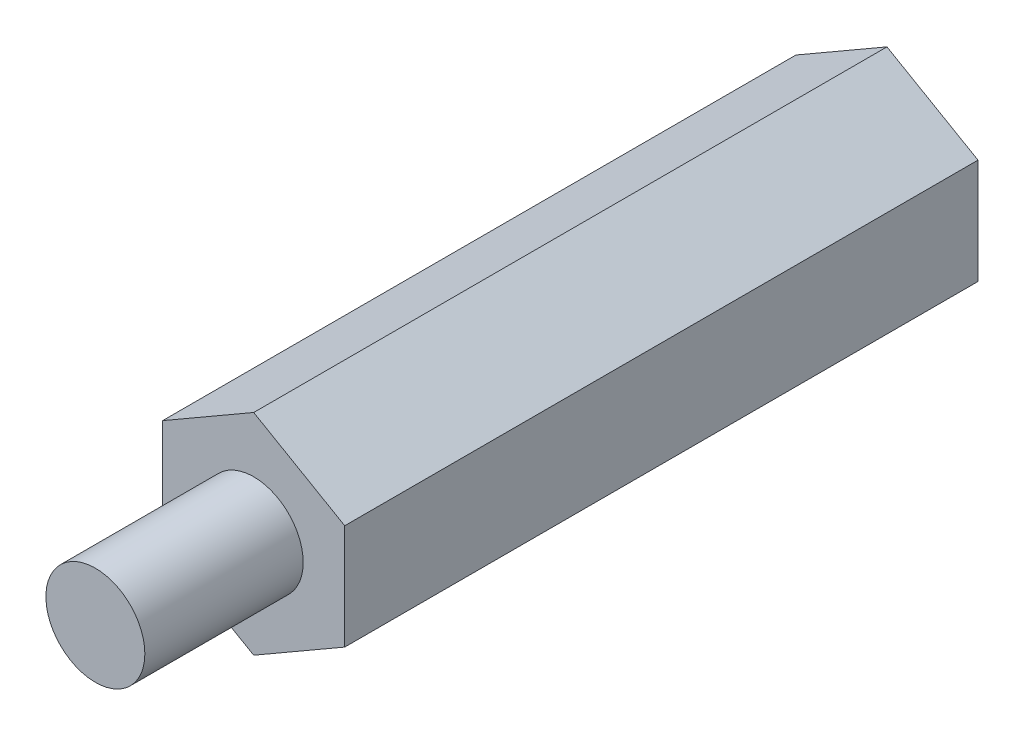
ISO-10303-21;
HEADER;
FILE_DESCRIPTION(('STEP AP214'),'2;1');
FILE_NAME('part.step','',(''),(''),'','','');
FILE_SCHEMA(('AUTOMOTIVE_DESIGN { 1 0 10303 214 1 1 1 1 }'));
ENDSEC;
DATA;
#1=APPLICATION_CONTEXT('core data for automotive mechanical design processes');
#2=APPLICATION_PROTOCOL_DEFINITION('international standard','automotive_design',2000,#1);
#3=PRODUCT_CONTEXT('',#1,'mechanical');
#4=PRODUCT('Part','Part','',(#3));
#5=PRODUCT_RELATED_PRODUCT_CATEGORY('part','',(#4));
#6=PRODUCT_DEFINITION_FORMATION('','',#4);
#7=PRODUCT_DEFINITION_CONTEXT('part definition',#1,'design');
#8=PRODUCT_DEFINITION('design','',#6,#7);
#9=PRODUCT_DEFINITION_SHAPE('','',#8);
#10=(LENGTH_UNIT() NAMED_UNIT(*) SI_UNIT(.MILLI.,.METRE.));
#11=(NAMED_UNIT(*) PLANE_ANGLE_UNIT() SI_UNIT($,.RADIAN.));
#12=(NAMED_UNIT(*) SI_UNIT($,.STERADIAN.) SOLID_ANGLE_UNIT());
#13=UNCERTAINTY_MEASURE_WITH_UNIT(LENGTH_MEASURE(1.E-05),#10,'distance_accuracy_value','');
#14=(GEOMETRIC_REPRESENTATION_CONTEXT(3) GLOBAL_UNCERTAINTY_ASSIGNED_CONTEXT((#13)) GLOBAL_UNIT_ASSIGNED_CONTEXT((#10,
#11,#12)) REPRESENTATION_CONTEXT('',''));
#15=CARTESIAN_POINT('',(0.,0.,0.));
#16=DIRECTION('',(0.,0.,1.));
#17=DIRECTION('',(1.,0.,0.));
#18=AXIS2_PLACEMENT_3D('',#15,#16,#17);
#19=CARTESIAN_POINT('',(2.3,1.32790561913614,0.));
#20=DIRECTION('',(0.5,0.866025403784439,0.));
#21=DIRECTION('',(0.,0.,-1.));
#22=AXIS2_PLACEMENT_3D('',#19,#20,#21);
#23=PLANE('',#22);
#24=DIRECTION('',(0.,0.,1.));
#25=VECTOR('',#24,1.);
#26=CARTESIAN_POINT('',(2.3,1.32790561913614,0.));
#27=LINE('',#26,#25);
#28=CARTESIAN_POINT('',(2.3,1.32790561913614,6.));
#29=VERTEX_POINT('',#28);
#30=CARTESIAN_POINT('',(2.3,1.32790561913614,22.));
#31=VERTEX_POINT('',#30);
#32=EDGE_CURVE('E28',#29,#31,#27,.T.);
#33=ORIENTED_EDGE('',*,*,#32,.F.);
#34=DIRECTION('',(0.866025403784439,-0.5,0.));
#35=VECTOR('',#34,1.);
#36=CARTESIAN_POINT('',(1.725,1.65988202392017,6.));
#37=LINE('',#36,#35);
#38=CARTESIAN_POINT('',(0.,2.65581123827228,6.));
#39=VERTEX_POINT('',#38);
#40=EDGE_CURVE('E194',#39,#29,#37,.T.);
#41=ORIENTED_EDGE('',*,*,#40,.F.);
#42=DIRECTION('',(0.,0.,1.));
#43=VECTOR('',#42,1.);
#44=CARTESIAN_POINT('',(0.,2.65581123827228,0.));
#45=LINE('',#44,#43);
#46=CARTESIAN_POINT('',(0.,2.65581123827228,22.));
#47=VERTEX_POINT('',#46);
#48=EDGE_CURVE('E108',#39,#47,#45,.T.);
#49=ORIENTED_EDGE('',*,*,#48,.T.);
#50=DIRECTION('',(-0.866025403784439,0.5,0.));
#51=VECTOR('',#50,1.);
#52=CARTESIAN_POINT('',(1.725,1.65988202392017,22.));
#53=LINE('',#52,#51);
#54=EDGE_CURVE('E124',#31,#47,#53,.T.);
#55=ORIENTED_EDGE('',*,*,#54,.F.);
#56=EDGE_LOOP('',(#33,#41,#49,#55));
#57=FACE_BOUND('',#56,.T.);
#58=ADVANCED_FACE('F17',(#57),#23,.T.);
#59=CARTESIAN_POINT('',(0.,0.,0.));
#60=DIRECTION('',(0.,0.,1.));
#61=DIRECTION('',(1.,0.,0.));
#62=AXIS2_PLACEMENT_3D('',#59,#60,#61);
#63=CYLINDRICAL_SURFACE('',#62,1.25);
#64=CARTESIAN_POINT('',(0.,0.,20.));
#65=DIRECTION('',(0.,0.,1.));
#66=DIRECTION('',(1.,0.,0.));
#67=AXIS2_PLACEMENT_3D('',#64,#65,#66);
#68=CIRCLE('',#67,1.25);
#69=CARTESIAN_POINT('',(-1.25,0.,20.));
#70=VERTEX_POINT('',#69);
#71=EDGE_CURVE('E125',#70,#70,#68,.T.);
#72=ORIENTED_EDGE('',*,*,#71,.T.);
#73=DIRECTION('',(0.,0.,-1.));
#74=VECTOR('',#73,1.);
#75=CARTESIAN_POINT('',(-1.25,0.,0.));
#76=LINE('',#75,#74);
#77=CARTESIAN_POINT('',(-1.25,0.,6.));
#78=VERTEX_POINT('',#77);
#79=EDGE_CURVE('E11',#70,#78,#76,.T.);
#80=ORIENTED_EDGE('',*,*,#79,.T.);
#81=CARTESIAN_POINT('',(0.,0.,6.));
#82=DIRECTION('',(0.,0.,1.));
#83=DIRECTION('',(1.,0.,0.));
#84=AXIS2_PLACEMENT_3D('',#81,#82,#83);
#85=CIRCLE('',#84,1.25);
#86=EDGE_CURVE('E21',#78,#78,#85,.T.);
#87=ORIENTED_EDGE('',*,*,#86,.F.);
#88=ORIENTED_EDGE('',*,*,#79,.F.);
#89=EDGE_LOOP('',(#72,#80,#87,#88));
#90=FACE_BOUND('',#89,.T.);
#91=ADVANCED_FACE('F210',(#90),#63,.F.);
#92=CARTESIAN_POINT('',(2.3,-1.32790561913614,0.));
#93=DIRECTION('',(1.,0.,0.));
#94=DIRECTION('',(0.,-1.,0.));
#95=AXIS2_PLACEMENT_3D('',#92,#93,#94);
#96=PLANE('',#95);
#97=DIRECTION('',(0.,0.,1.));
#98=VECTOR('',#97,1.);
#99=CARTESIAN_POINT('',(2.3,-1.32790561913614,0.));
#100=LINE('',#99,#98);
#101=CARTESIAN_POINT('',(2.3,-1.32790561913614,6.));
#102=VERTEX_POINT('',#101);
#103=CARTESIAN_POINT('',(2.3,-1.32790561913614,22.));
#104=VERTEX_POINT('',#103);
#105=EDGE_CURVE('E96',#102,#104,#100,.T.);
#106=ORIENTED_EDGE('',*,*,#105,.F.);
#107=DIRECTION('',(0.,-1.,0.));
#108=VECTOR('',#107,1.);
#109=CARTESIAN_POINT('',(2.3,-0.663952809568071,6.));
#110=LINE('',#109,#108);
#111=EDGE_CURVE('E143',#29,#102,#110,.T.);
#112=ORIENTED_EDGE('',*,*,#111,.F.);
#113=ORIENTED_EDGE('',*,*,#32,.T.);
#114=DIRECTION('',(0.,1.,0.));
#115=VECTOR('',#114,1.);
#116=CARTESIAN_POINT('',(2.3,-0.663952809568071,22.));
#117=LINE('',#116,#115);
#118=EDGE_CURVE('E114',#104,#31,#117,.T.);
#119=ORIENTED_EDGE('',*,*,#118,.F.);
#120=EDGE_LOOP('',(#106,#112,#113,#119));
#121=FACE_BOUND('',#120,.T.);
#122=ADVANCED_FACE('F120',(#121),#96,.T.);
#123=CARTESIAN_POINT('',(0.,-2.65581123827228,0.));
#124=DIRECTION('',(0.5,-0.866025403784439,0.));
#125=DIRECTION('',(0.,0.,-1.));
#126=AXIS2_PLACEMENT_3D('',#123,#124,#125);
#127=PLANE('',#126);
#128=DIRECTION('',(0.,0.,1.));
#129=VECTOR('',#128,1.);
#130=CARTESIAN_POINT('',(0.,-2.65581123827228,0.));
#131=LINE('',#130,#129);
#132=CARTESIAN_POINT('',(0.,-2.65581123827228,6.));
#133=VERTEX_POINT('',#132);
#134=CARTESIAN_POINT('',(0.,-2.65581123827228,22.));
#135=VERTEX_POINT('',#134);
#136=EDGE_CURVE('E42',#133,#135,#131,.T.);
#137=ORIENTED_EDGE('',*,*,#136,.F.);
#138=DIRECTION('',(-0.866025403784439,-0.5,0.));
#139=VECTOR('',#138,1.);
#140=CARTESIAN_POINT('',(0.575,-2.32383483348824,6.));
#141=LINE('',#140,#139);
#142=EDGE_CURVE('E102',#102,#133,#141,.T.);
#143=ORIENTED_EDGE('',*,*,#142,.F.);
#144=ORIENTED_EDGE('',*,*,#105,.T.);
#145=DIRECTION('',(0.866025403784439,0.5,0.));
#146=VECTOR('',#145,1.);
#147=CARTESIAN_POINT('',(0.575,-2.32383483348824,22.));
#148=LINE('',#147,#146);
#149=EDGE_CURVE('E99',#135,#104,#148,.T.);
#150=ORIENTED_EDGE('',*,*,#149,.F.);
#151=EDGE_LOOP('',(#137,#143,#144,#150));
#152=FACE_BOUND('',#151,.T.);
#153=ADVANCED_FACE('F98',(#152),#127,.T.);
#154=CARTESIAN_POINT('',(0.,2.65581123827228,0.));
#155=DIRECTION('',(-0.5,0.866025403784439,0.));
#156=DIRECTION('',(0.,0.,1.));
#157=AXIS2_PLACEMENT_3D('',#154,#155,#156);
#158=PLANE('',#157);
#159=ORIENTED_EDGE('',*,*,#48,.F.);
#160=DIRECTION('',(0.866025403784439,0.5,0.));
#161=VECTOR('',#160,1.);
#162=CARTESIAN_POINT('',(-0.575,2.32383483348824,6.));
#163=LINE('',#162,#161);
#164=CARTESIAN_POINT('',(-2.3,1.32790561913614,6.));
#165=VERTEX_POINT('',#164);
#166=EDGE_CURVE('E138',#165,#39,#163,.T.);
#167=ORIENTED_EDGE('',*,*,#166,.F.);
#168=DIRECTION('',(0.,0.,1.));
#169=VECTOR('',#168,1.);
#170=CARTESIAN_POINT('',(-2.3,1.32790561913614,18.));
#171=LINE('',#170,#169);
#172=CARTESIAN_POINT('',(-2.3,1.32790561913614,22.));
#173=VERTEX_POINT('',#172);
#174=EDGE_CURVE('E170',#165,#173,#171,.T.);
#175=ORIENTED_EDGE('',*,*,#174,.T.);
#176=DIRECTION('',(-0.866025403784439,-0.5,0.));
#177=VECTOR('',#176,1.);
#178=CARTESIAN_POINT('',(-0.575,2.32383483348824,22.));
#179=LINE('',#178,#177);
#180=EDGE_CURVE('E132',#47,#173,#179,.T.);
#181=ORIENTED_EDGE('',*,*,#180,.F.);
#182=EDGE_LOOP('',(#159,#167,#175,#181));
#183=FACE_BOUND('',#182,.T.);
#184=ADVANCED_FACE('F241',(#183),#158,.T.);
#185=CARTESIAN_POINT('',(-2.3,1.32790561913614,0.));
#186=DIRECTION('',(-1.,0.,0.));
#187=DIRECTION('',(0.,0.,1.));
#188=AXIS2_PLACEMENT_3D('',#185,#186,#187);
#189=PLANE('',#188);
#190=ORIENTED_EDGE('',*,*,#174,.F.);
#191=DIRECTION('',(0.,1.,0.));
#192=VECTOR('',#191,1.);
#193=CARTESIAN_POINT('',(-2.3,0.66395280956807,6.));
#194=LINE('',#193,#192);
#195=CARTESIAN_POINT('',(-2.3,-1.32790561913614,6.));
#196=VERTEX_POINT('',#195);
#197=EDGE_CURVE('E178',#196,#165,#194,.T.);
#198=ORIENTED_EDGE('',*,*,#197,.F.);
#199=DIRECTION('',(0.,0.,1.));
#200=VECTOR('',#199,1.);
#201=CARTESIAN_POINT('',(-2.3,-1.32790561913614,18.));
#202=LINE('',#201,#200);
#203=CARTESIAN_POINT('',(-2.3,-1.32790561913614,22.));
#204=VERTEX_POINT('',#203);
#205=EDGE_CURVE('E118',#196,#204,#202,.T.);
#206=ORIENTED_EDGE('',*,*,#205,.T.);
#207=DIRECTION('',(0.,-1.,0.));
#208=VECTOR('',#207,1.);
#209=CARTESIAN_POINT('',(-2.3,0.66395280956807,22.));
#210=LINE('',#209,#208);
#211=EDGE_CURVE('E141',#173,#204,#210,.T.);
#212=ORIENTED_EDGE('',*,*,#211,.F.);
#213=EDGE_LOOP('',(#190,#198,#206,#212));
#214=FACE_BOUND('',#213,.T.);
#215=ADVANCED_FACE('F238',(#214),#189,.T.);
#216=CARTESIAN_POINT('',(-2.3,-1.32790561913614,0.));
#217=DIRECTION('',(-0.5,-0.866025403784439,0.));
#218=DIRECTION('',(-0.866025403784439,0.5,0.));
#219=AXIS2_PLACEMENT_3D('',#216,#217,#218);
#220=PLANE('',#219);
#221=ORIENTED_EDGE('',*,*,#205,.F.);
#222=DIRECTION('',(-0.866025403784439,0.5,0.));
#223=VECTOR('',#222,1.);
#224=CARTESIAN_POINT('',(-1.725,-1.65988202392017,6.));
#225=LINE('',#224,#223);
#226=EDGE_CURVE('E174',#133,#196,#225,.T.);
#227=ORIENTED_EDGE('',*,*,#226,.F.);
#228=ORIENTED_EDGE('',*,*,#136,.T.);
#229=DIRECTION('',(0.866025403784439,-0.5,0.));
#230=VECTOR('',#229,1.);
#231=CARTESIAN_POINT('',(-1.725,-1.65988202392017,22.));
#232=LINE('',#231,#230);
#233=EDGE_CURVE('E116',#204,#135,#232,.T.);
#234=ORIENTED_EDGE('',*,*,#233,.F.);
#235=EDGE_LOOP('',(#221,#227,#228,#234));
#236=FACE_BOUND('',#235,.T.);
#237=ADVANCED_FACE('F225',(#236),#220,.T.);
#238=CARTESIAN_POINT('',(0.,0.,22.));
#239=DIRECTION('',(0.,0.,1.));
#240=DIRECTION('',(1.,0.,0.));
#241=AXIS2_PLACEMENT_3D('',#238,#239,#240);
#242=PLANE('',#241);
#243=CARTESIAN_POINT('',(0.,0.,22.));
#244=DIRECTION('',(0.,0.,-1.));
#245=DIRECTION('',(-1.,0.,0.));
#246=AXIS2_PLACEMENT_3D('',#243,#244,#245);
#247=CIRCLE('',#246,1.25);
#248=CARTESIAN_POINT('',(1.25,0.,22.));
#249=VERTEX_POINT('',#248);
#250=EDGE_CURVE('E135',#249,#249,#247,.T.);
#251=ORIENTED_EDGE('',*,*,#250,.T.);
#252=EDGE_LOOP('',(#251));
#253=FACE_BOUND('',#252,.T.);
#254=ORIENTED_EDGE('',*,*,#118,.T.);
#255=ORIENTED_EDGE('',*,*,#54,.T.);
#256=ORIENTED_EDGE('',*,*,#180,.T.);
#257=ORIENTED_EDGE('',*,*,#211,.T.);
#258=ORIENTED_EDGE('',*,*,#233,.T.);
#259=ORIENTED_EDGE('',*,*,#149,.T.);
#260=EDGE_LOOP('',(#254,#255,#256,#257,#258,#259));
#261=FACE_BOUND('',#260,.T.);
#262=ADVANCED_FACE('F112',(#253,#261),#242,.T.);
#263=CARTESIAN_POINT('',(0.,0.,20.));
#264=DIRECTION('',(0.,0.,1.));
#265=DIRECTION('',(1.,0.,0.));
#266=AXIS2_PLACEMENT_3D('',#263,#264,#265);
#267=PLANE('',#266);
#268=ORIENTED_EDGE('',*,*,#71,.F.);
#269=EDGE_LOOP('',(#268));
#270=FACE_BOUND('',#269,.T.);
#271=ADVANCED_FACE('F213',(#270),#267,.F.);
#272=CARTESIAN_POINT('',(0.,0.,26.));
#273=DIRECTION('',(0.,0.,1.));
#274=DIRECTION('',(1.,0.,0.));
#275=AXIS2_PLACEMENT_3D('',#272,#273,#274);
#276=PLANE('',#275);
#277=CARTESIAN_POINT('',(0.,0.,26.));
#278=DIRECTION('',(0.,0.,1.));
#279=DIRECTION('',(-1.,0.,0.));
#280=AXIS2_PLACEMENT_3D('',#277,#278,#279);
#281=CIRCLE('',#280,1.25);
#282=CARTESIAN_POINT('',(1.25,0.,26.));
#283=VERTEX_POINT('',#282);
#284=EDGE_CURVE('E154',#283,#283,#281,.T.);
#285=ORIENTED_EDGE('',*,*,#284,.T.);
#286=EDGE_LOOP('',(#285));
#287=FACE_BOUND('',#286,.T.);
#288=ADVANCED_FACE('F215',(#287),#276,.T.);
#289=CARTESIAN_POINT('',(0.,0.,22.));
#290=DIRECTION('',(0.,0.,1.));
#291=DIRECTION('',(-1.,0.,0.));
#292=AXIS2_PLACEMENT_3D('',#289,#290,#291);
#293=CYLINDRICAL_SURFACE('',#292,1.25);
#294=ORIENTED_EDGE('',*,*,#284,.F.);
#295=DIRECTION('',(0.,0.,-1.));
#296=VECTOR('',#295,1.);
#297=CARTESIAN_POINT('',(1.25,0.,22.));
#298=LINE('',#297,#296);
#299=EDGE_CURVE('E147',#283,#249,#298,.T.);
#300=ORIENTED_EDGE('',*,*,#299,.T.);
#301=ORIENTED_EDGE('',*,*,#250,.F.);
#302=ORIENTED_EDGE('',*,*,#299,.F.);
#303=EDGE_LOOP('',(#294,#300,#301,#302));
#304=FACE_BOUND('',#303,.T.);
#305=ADVANCED_FACE('F223',(#304),#293,.T.);
#306=CARTESIAN_POINT('',(0.,0.,6.));
#307=DIRECTION('',(0.,0.,1.));
#308=DIRECTION('',(1.,0.,0.));
#309=AXIS2_PLACEMENT_3D('',#306,#307,#308);
#310=PLANE('',#309);
#311=ORIENTED_EDGE('',*,*,#86,.T.);
#312=EDGE_LOOP('',(#311));
#313=FACE_BOUND('',#312,.T.);
#314=ORIENTED_EDGE('',*,*,#111,.T.);
#315=ORIENTED_EDGE('',*,*,#142,.T.);
#316=ORIENTED_EDGE('',*,*,#226,.T.);
#317=ORIENTED_EDGE('',*,*,#197,.T.);
#318=ORIENTED_EDGE('',*,*,#166,.T.);
#319=ORIENTED_EDGE('',*,*,#40,.T.);
#320=EDGE_LOOP('',(#314,#315,#316,#317,#318,#319));
#321=FACE_BOUND('',#320,.T.);
#322=ADVANCED_FACE('F19',(#313,#321),#310,.F.);
#323=CLOSED_SHELL('',(#58,#91,#122,#153,#184,#215,#237,#262,#271,#288,#305,#322));
#324=MANIFOLD_SOLID_BREP('B1',#323);
#325=ADVANCED_BREP_SHAPE_REPRESENTATION('',(#18,#324),#14);
#326=SHAPE_DEFINITION_REPRESENTATION(#9,#325);
ENDSEC;
END-ISO-10303-21;
